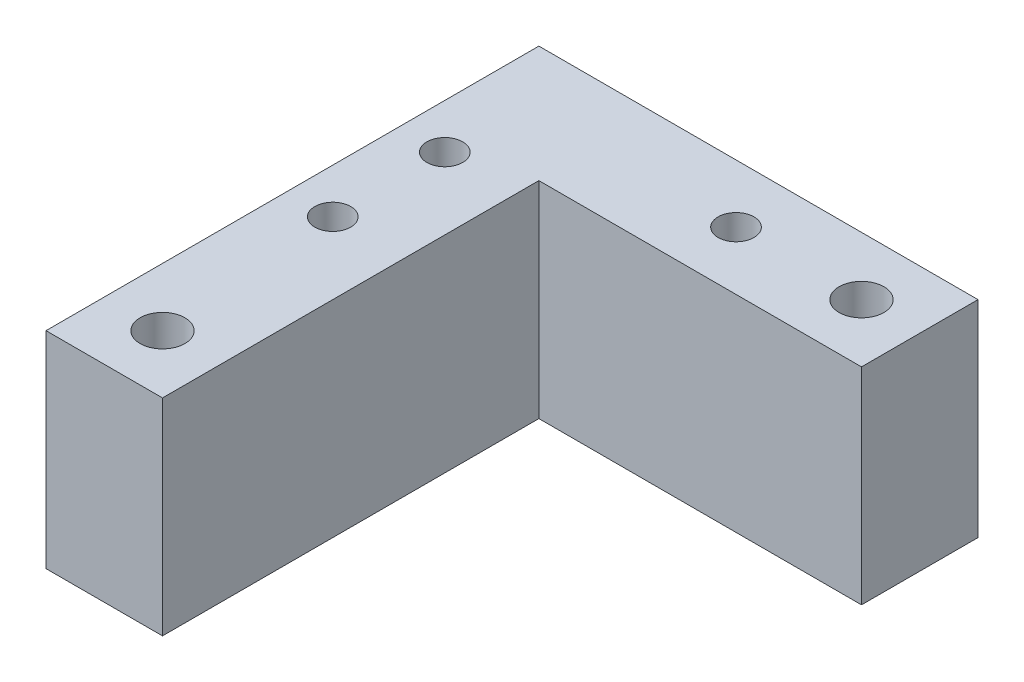
ISO-10303-21;
HEADER;
FILE_DESCRIPTION(('STEP AP214'),'2;1');
FILE_NAME('part.step','',(''),(''),'','','');
FILE_SCHEMA(('AUTOMOTIVE_DESIGN { 1 0 10303 214 1 1 1 1 }'));
ENDSEC;
DATA;
#1=APPLICATION_CONTEXT('core data for automotive mechanical design processes');
#2=APPLICATION_PROTOCOL_DEFINITION('international standard','automotive_design',2000,#1);
#3=PRODUCT_CONTEXT('',#1,'mechanical');
#4=PRODUCT('Part','Part','',(#3));
#5=PRODUCT_RELATED_PRODUCT_CATEGORY('part','',(#4));
#6=PRODUCT_DEFINITION_FORMATION('','',#4);
#7=PRODUCT_DEFINITION_CONTEXT('part definition',#1,'design');
#8=PRODUCT_DEFINITION('design','',#6,#7);
#9=PRODUCT_DEFINITION_SHAPE('','',#8);
#10=(LENGTH_UNIT() NAMED_UNIT(*) SI_UNIT(.MILLI.,.METRE.));
#11=(NAMED_UNIT(*) PLANE_ANGLE_UNIT() SI_UNIT($,.RADIAN.));
#12=(NAMED_UNIT(*) SI_UNIT($,.STERADIAN.) SOLID_ANGLE_UNIT());
#13=UNCERTAINTY_MEASURE_WITH_UNIT(LENGTH_MEASURE(1.E-05),#10,'distance_accuracy_value','');
#14=(GEOMETRIC_REPRESENTATION_CONTEXT(3) GLOBAL_UNCERTAINTY_ASSIGNED_CONTEXT((#13)) GLOBAL_UNIT_ASSIGNED_CONTEXT((#10,
#11,#12)) REPRESENTATION_CONTEXT('',''));
#15=CARTESIAN_POINT('',(0.,0.,0.));
#16=DIRECTION('',(0.,0.,1.));
#17=DIRECTION('',(1.,0.,0.));
#18=AXIS2_PLACEMENT_3D('',#15,#16,#17);
#19=CARTESIAN_POINT('',(-18.6079295154185,23.,-6.45154185022027));
#20=DIRECTION('',(0.,-1.,0.));
#21=DIRECTION('',(0.,0.,-1.));
#22=AXIS2_PLACEMENT_3D('',#19,#20,#21);
#23=CYLINDRICAL_SURFACE('',#22,2.);
#24=CARTESIAN_POINT('',(-18.6079295154185,23.,-6.45154185022027));
#25=DIRECTION('',(0.,1.,0.));
#26=DIRECTION('',(0.,0.,1.));
#27=AXIS2_PLACEMENT_3D('',#24,#25,#26);
#28=CIRCLE('',#27,2.);
#29=CARTESIAN_POINT('',(-18.6079295154185,23.,-4.45154185022027));
#30=VERTEX_POINT('',#29);
#31=EDGE_CURVE('E116',#30,#30,#28,.T.);
#32=ORIENTED_EDGE('',*,*,#31,.T.);
#33=EDGE_LOOP('',(#32));
#34=FACE_BOUND('',#33,.T.);
#35=CARTESIAN_POINT('',(-18.6079295154185,4.4,-6.45154185022027));
#36=DIRECTION('',(0.,-1.,0.));
#37=DIRECTION('',(0.,0.,-1.));
#38=AXIS2_PLACEMENT_3D('',#35,#36,#37);
#39=CIRCLE('',#38,2.);
#40=CARTESIAN_POINT('',(-18.6079295154185,4.4,-8.45154185022027));
#41=VERTEX_POINT('',#40);
#42=EDGE_CURVE('E37',#41,#41,#39,.T.);
#43=ORIENTED_EDGE('',*,*,#42,.T.);
#44=EDGE_LOOP('',(#43));
#45=FACE_BOUND('',#44,.T.);
#46=ADVANCED_FACE('F33',(#34,#45),#23,.F.);
#47=CARTESIAN_POINT('',(4.89207048458148,23.,-15.4515418502203));
#48=DIRECTION('',(0.,-1.,0.));
#49=DIRECTION('',(0.,0.,-1.));
#50=AXIS2_PLACEMENT_3D('',#47,#48,#49);
#51=CYLINDRICAL_SURFACE('',#50,2.);
#52=CARTESIAN_POINT('',(4.89207048458148,23.,-15.4515418502203));
#53=DIRECTION('',(0.,1.,0.));
#54=DIRECTION('',(0.,0.,1.));
#55=AXIS2_PLACEMENT_3D('',#52,#53,#54);
#56=CIRCLE('',#55,2.);
#57=CARTESIAN_POINT('',(4.89207048458148,23.,-13.4515418502203));
#58=VERTEX_POINT('',#57);
#59=EDGE_CURVE('E98',#58,#58,#56,.T.);
#60=ORIENTED_EDGE('',*,*,#59,.T.);
#61=EDGE_LOOP('',(#60));
#62=FACE_BOUND('',#61,.T.);
#63=CARTESIAN_POINT('',(4.89207048458148,4.4,-15.4515418502203));
#64=DIRECTION('',(0.,-1.,0.));
#65=DIRECTION('',(0.,0.,-1.));
#66=AXIS2_PLACEMENT_3D('',#63,#64,#65);
#67=CIRCLE('',#66,2.);
#68=CARTESIAN_POINT('',(4.89207048458148,4.4,-17.4515418502203));
#69=VERTEX_POINT('',#68);
#70=EDGE_CURVE('E138',#69,#69,#67,.T.);
#71=ORIENTED_EDGE('',*,*,#70,.T.);
#72=EDGE_LOOP('',(#71));
#73=FACE_BOUND('',#72,.T.);
#74=ADVANCED_FACE('F207',(#62,#73),#51,.F.);
#75=CARTESIAN_POINT('',(-18.6079295154185,23.,6.04845814977973));
#76=DIRECTION('',(0.,-1.,0.));
#77=DIRECTION('',(0.,0.,-1.));
#78=AXIS2_PLACEMENT_3D('',#75,#76,#77);
#79=CYLINDRICAL_SURFACE('',#78,2.);
#80=CARTESIAN_POINT('',(-18.6079295154185,23.,6.04845814977973));
#81=DIRECTION('',(0.,1.,0.));
#82=DIRECTION('',(0.,0.,1.));
#83=AXIS2_PLACEMENT_3D('',#80,#81,#82);
#84=CIRCLE('',#83,2.);
#85=CARTESIAN_POINT('',(-18.6079295154185,23.,8.04845814977973));
#86=VERTEX_POINT('',#85);
#87=EDGE_CURVE('E119',#86,#86,#84,.T.);
#88=ORIENTED_EDGE('',*,*,#87,.T.);
#89=EDGE_LOOP('',(#88));
#90=FACE_BOUND('',#89,.T.);
#91=CARTESIAN_POINT('',(-18.6079295154185,4.4,6.04845814977973));
#92=DIRECTION('',(0.,-1.,0.));
#93=DIRECTION('',(0.,0.,-1.));
#94=AXIS2_PLACEMENT_3D('',#91,#92,#93);
#95=CIRCLE('',#94,2.);
#96=CARTESIAN_POINT('',(-18.6079295154185,4.4,4.04845814977973));
#97=VERTEX_POINT('',#96);
#98=EDGE_CURVE('E134',#97,#97,#95,.T.);
#99=ORIENTED_EDGE('',*,*,#98,.T.);
#100=EDGE_LOOP('',(#99));
#101=FACE_BOUND('',#100,.T.);
#102=ADVANCED_FACE('F214',(#90,#101),#79,.F.);
#103=CARTESIAN_POINT('',(0.,23.,0.));
#104=DIRECTION('',(0.,-1.,0.));
#105=DIRECTION('',(0.,0.,-1.));
#106=AXIS2_PLACEMENT_3D('',#103,#104,#105);
#107=PLANE('',#106);
#108=CARTESIAN_POINT('',(-17.1079295154185,23.,26.5484581497797));
#109=DIRECTION('',(0.,1.,0.));
#110=DIRECTION('',(0.,0.,1.));
#111=AXIS2_PLACEMENT_3D('',#108,#109,#110);
#112=CIRCLE('',#111,2.5);
#113=CARTESIAN_POINT('',(-17.1079295154185,23.,29.0484581497797));
#114=VERTEX_POINT('',#113);
#115=EDGE_CURVE('E136',#114,#114,#112,.T.);
#116=ORIENTED_EDGE('',*,*,#115,.F.);
#117=EDGE_LOOP('',(#116));
#118=FACE_BOUND('',#117,.T.);
#119=CARTESIAN_POINT('',(18.8920704845815,23.,-15.4515418502203));
#120=DIRECTION('',(0.,1.,0.));
#121=DIRECTION('',(0.,0.,1.));
#122=AXIS2_PLACEMENT_3D('',#119,#120,#121);
#123=CIRCLE('',#122,2.5);
#124=CARTESIAN_POINT('',(18.8920704845815,23.,-12.9515418502203));
#125=VERTEX_POINT('',#124);
#126=EDGE_CURVE('E166',#125,#125,#123,.T.);
#127=ORIENTED_EDGE('',*,*,#126,.F.);
#128=EDGE_LOOP('',(#127));
#129=FACE_BOUND('',#128,.T.);
#130=DIRECTION('',(0.,0.,1.));
#131=VECTOR('',#130,1.);
#132=CARTESIAN_POINT('',(-23.6079295154185,23.,18.0484581497797));
#133=LINE('',#132,#131);
#134=CARTESIAN_POINT('',(-23.6079295154185,23.,-21.9515418502203));
#135=VERTEX_POINT('',#134);
#136=CARTESIAN_POINT('',(-23.6079295154185,23.,33.0484581497797));
#137=VERTEX_POINT('',#136);
#138=EDGE_CURVE('E89',#135,#137,#133,.T.);
#139=ORIENTED_EDGE('',*,*,#138,.T.);
#140=DIRECTION('',(1.,0.,0.));
#141=VECTOR('',#140,1.);
#142=CARTESIAN_POINT('',(-23.6079295154185,23.,33.0484581497797));
#143=LINE('',#142,#141);
#144=CARTESIAN_POINT('',(-10.6079295154185,23.,33.0484581497797));
#145=VERTEX_POINT('',#144);
#146=EDGE_CURVE('E172',#137,#145,#143,.T.);
#147=ORIENTED_EDGE('',*,*,#146,.T.);
#148=DIRECTION('',(0.,0.,-1.));
#149=VECTOR('',#148,1.);
#150=CARTESIAN_POINT('',(-10.6079295154185,23.,-8.95154185022026));
#151=LINE('',#150,#149);
#152=CARTESIAN_POINT('',(-10.6079295154185,23.,-8.95154185022026));
#153=VERTEX_POINT('',#152);
#154=EDGE_CURVE('E122',#145,#153,#151,.T.);
#155=ORIENTED_EDGE('',*,*,#154,.T.);
#156=DIRECTION('',(1.,0.,0.));
#157=VECTOR('',#156,1.);
#158=CARTESIAN_POINT('',(10.3920704845815,23.,-8.95154185022026));
#159=LINE('',#158,#157);
#160=CARTESIAN_POINT('',(25.3920704845815,23.,-8.95154185022027));
#161=VERTEX_POINT('',#160);
#162=EDGE_CURVE('E90',#153,#161,#159,.T.);
#163=ORIENTED_EDGE('',*,*,#162,.T.);
#164=DIRECTION('',(0.,0.,-1.));
#165=VECTOR('',#164,1.);
#166=CARTESIAN_POINT('',(25.3920704845815,23.,-21.9515418502203));
#167=LINE('',#166,#165);
#168=CARTESIAN_POINT('',(25.3920704845815,23.,-21.9515418502203));
#169=VERTEX_POINT('',#168);
#170=EDGE_CURVE('E96',#161,#169,#167,.T.);
#171=ORIENTED_EDGE('',*,*,#170,.T.);
#172=DIRECTION('',(-1.,0.,0.));
#173=VECTOR('',#172,1.);
#174=CARTESIAN_POINT('',(-23.6079295154185,23.,-21.9515418502203));
#175=LINE('',#174,#173);
#176=EDGE_CURVE('E52',#169,#135,#175,.T.);
#177=ORIENTED_EDGE('',*,*,#176,.T.);
#178=EDGE_LOOP('',(#139,#147,#155,#163,#171,#177));
#179=FACE_BOUND('',#178,.T.);
#180=ORIENTED_EDGE('',*,*,#87,.F.);
#181=EDGE_LOOP('',(#180));
#182=FACE_BOUND('',#181,.T.);
#183=ORIENTED_EDGE('',*,*,#31,.F.);
#184=EDGE_LOOP('',(#183));
#185=FACE_BOUND('',#184,.T.);
#186=ORIENTED_EDGE('',*,*,#59,.F.);
#187=EDGE_LOOP('',(#186));
#188=FACE_BOUND('',#187,.T.);
#189=ADVANCED_FACE('F101',(#118,#129,#179,#182,#185,#188),#107,.F.);
#190=CARTESIAN_POINT('',(0.,0.,0.));
#191=DIRECTION('',(0.,-1.,0.));
#192=DIRECTION('',(0.,0.,-1.));
#193=AXIS2_PLACEMENT_3D('',#190,#191,#192);
#194=PLANE('',#193);
#195=CARTESIAN_POINT('',(-18.6079295154185,0.,-6.45154185022027));
#196=DIRECTION('',(0.,-1.,0.));
#197=DIRECTION('',(0.,0.,-1.));
#198=AXIS2_PLACEMENT_3D('',#195,#196,#197);
#199=CIRCLE('',#198,4.);
#200=CARTESIAN_POINT('',(-18.6079295154185,0.,-10.4515418502203));
#201=VERTEX_POINT('',#200);
#202=EDGE_CURVE('E146',#201,#201,#199,.T.);
#203=ORIENTED_EDGE('',*,*,#202,.F.);
#204=EDGE_LOOP('',(#203));
#205=FACE_BOUND('',#204,.T.);
#206=CARTESIAN_POINT('',(4.89207048458148,0.,-15.4515418502203));
#207=DIRECTION('',(0.,-1.,0.));
#208=DIRECTION('',(0.,0.,-1.));
#209=AXIS2_PLACEMENT_3D('',#206,#207,#208);
#210=CIRCLE('',#209,4.);
#211=CARTESIAN_POINT('',(4.89207048458148,0.,-19.4515418502203));
#212=VERTEX_POINT('',#211);
#213=EDGE_CURVE('E156',#212,#212,#210,.T.);
#214=ORIENTED_EDGE('',*,*,#213,.F.);
#215=EDGE_LOOP('',(#214));
#216=FACE_BOUND('',#215,.T.);
#217=CARTESIAN_POINT('',(-18.6079295154185,0.,6.04845814977973));
#218=DIRECTION('',(0.,-1.,0.));
#219=DIRECTION('',(0.,0.,-1.));
#220=AXIS2_PLACEMENT_3D('',#217,#218,#219);
#221=CIRCLE('',#220,4.);
#222=CARTESIAN_POINT('',(-18.6079295154185,0.,2.04845814977973));
#223=VERTEX_POINT('',#222);
#224=EDGE_CURVE('E144',#223,#223,#221,.T.);
#225=ORIENTED_EDGE('',*,*,#224,.F.);
#226=EDGE_LOOP('',(#225));
#227=FACE_BOUND('',#226,.T.);
#228=CARTESIAN_POINT('',(-17.1079295154185,0.,26.5484581497797));
#229=DIRECTION('',(0.,1.,0.));
#230=DIRECTION('',(0.,0.,1.));
#231=AXIS2_PLACEMENT_3D('',#228,#229,#230);
#232=CIRCLE('',#231,2.5);
#233=CARTESIAN_POINT('',(-17.1079295154185,0.,29.0484581497797));
#234=VERTEX_POINT('',#233);
#235=EDGE_CURVE('E163',#234,#234,#232,.T.);
#236=ORIENTED_EDGE('',*,*,#235,.T.);
#237=EDGE_LOOP('',(#236));
#238=FACE_BOUND('',#237,.T.);
#239=CARTESIAN_POINT('',(18.8920704845815,0.,-15.4515418502203));
#240=DIRECTION('',(0.,1.,0.));
#241=DIRECTION('',(0.,0.,1.));
#242=AXIS2_PLACEMENT_3D('',#239,#240,#241);
#243=CIRCLE('',#242,2.5);
#244=CARTESIAN_POINT('',(18.8920704845815,0.,-12.9515418502203));
#245=VERTEX_POINT('',#244);
#246=EDGE_CURVE('E169',#245,#245,#243,.T.);
#247=ORIENTED_EDGE('',*,*,#246,.T.);
#248=EDGE_LOOP('',(#247));
#249=FACE_BOUND('',#248,.T.);
#250=DIRECTION('',(0.,0.,-1.));
#251=VECTOR('',#250,1.);
#252=CARTESIAN_POINT('',(-10.6079295154185,0.,-8.95154185022026));
#253=LINE('',#252,#251);
#254=CARTESIAN_POINT('',(-10.6079295154185,0.,33.0484581497797));
#255=VERTEX_POINT('',#254);
#256=CARTESIAN_POINT('',(-10.6079295154185,0.,-8.95154185022026));
#257=VERTEX_POINT('',#256);
#258=EDGE_CURVE('E64',#255,#257,#253,.T.);
#259=ORIENTED_EDGE('',*,*,#258,.F.);
#260=DIRECTION('',(1.,0.,0.));
#261=VECTOR('',#260,1.);
#262=CARTESIAN_POINT('',(-23.6079295154185,0.,33.0484581497797));
#263=LINE('',#262,#261);
#264=CARTESIAN_POINT('',(-23.6079295154185,0.,33.0484581497797));
#265=VERTEX_POINT('',#264);
#266=EDGE_CURVE('E175',#265,#255,#263,.T.);
#267=ORIENTED_EDGE('',*,*,#266,.F.);
#268=DIRECTION('',(0.,0.,1.));
#269=VECTOR('',#268,1.);
#270=CARTESIAN_POINT('',(-23.6079295154185,0.,18.0484581497797));
#271=LINE('',#270,#269);
#272=CARTESIAN_POINT('',(-23.6079295154185,0.,-21.9515418502203));
#273=VERTEX_POINT('',#272);
#274=EDGE_CURVE('E124',#273,#265,#271,.T.);
#275=ORIENTED_EDGE('',*,*,#274,.F.);
#276=DIRECTION('',(-1.,0.,0.));
#277=VECTOR('',#276,1.);
#278=CARTESIAN_POINT('',(-23.6079295154185,0.,-21.9515418502203));
#279=LINE('',#278,#277);
#280=CARTESIAN_POINT('',(25.3920704845815,0.,-21.9515418502203));
#281=VERTEX_POINT('',#280);
#282=EDGE_CURVE('E72',#281,#273,#279,.T.);
#283=ORIENTED_EDGE('',*,*,#282,.F.);
#284=DIRECTION('',(0.,0.,-1.));
#285=VECTOR('',#284,1.);
#286=CARTESIAN_POINT('',(25.3920704845815,0.,-21.9515418502203));
#287=LINE('',#286,#285);
#288=CARTESIAN_POINT('',(25.3920704845815,0.,-8.95154185022027));
#289=VERTEX_POINT('',#288);
#290=EDGE_CURVE('E97',#289,#281,#287,.T.);
#291=ORIENTED_EDGE('',*,*,#290,.F.);
#292=DIRECTION('',(1.,0.,0.));
#293=VECTOR('',#292,1.);
#294=CARTESIAN_POINT('',(10.3920704845815,0.,-8.95154185022026));
#295=LINE('',#294,#293);
#296=EDGE_CURVE('E128',#257,#289,#295,.T.);
#297=ORIENTED_EDGE('',*,*,#296,.F.);
#298=EDGE_LOOP('',(#259,#267,#275,#283,#291,#297));
#299=FACE_BOUND('',#298,.T.);
#300=ADVANCED_FACE('F195',(#205,#216,#227,#238,#249,#299),#194,.T.);
#301=CARTESIAN_POINT('',(-10.6079295154185,23.,-8.95154185022026));
#302=DIRECTION('',(-1.,0.,0.));
#303=DIRECTION('',(0.,0.,1.));
#304=AXIS2_PLACEMENT_3D('',#301,#302,#303);
#305=PLANE('',#304);
#306=ORIENTED_EDGE('',*,*,#258,.T.);
#307=DIRECTION('',(0.,-1.,0.));
#308=VECTOR('',#307,1.);
#309=CARTESIAN_POINT('',(-10.6079295154185,23.,-8.95154185022026));
#310=LINE('',#309,#308);
#311=EDGE_CURVE('E11',#153,#257,#310,.T.);
#312=ORIENTED_EDGE('',*,*,#311,.F.);
#313=ORIENTED_EDGE('',*,*,#154,.F.);
#314=DIRECTION('',(0.,1.,0.));
#315=VECTOR('',#314,1.);
#316=CARTESIAN_POINT('',(-10.6079295154185,0.,33.0484581497797));
#317=LINE('',#316,#315);
#318=EDGE_CURVE('E105',#255,#145,#317,.T.);
#319=ORIENTED_EDGE('',*,*,#318,.F.);
#320=EDGE_LOOP('',(#306,#312,#313,#319));
#321=FACE_BOUND('',#320,.T.);
#322=ADVANCED_FACE('F35',(#321),#305,.F.);
#323=CARTESIAN_POINT('',(10.3920704845815,23.,-8.95154185022026));
#324=DIRECTION('',(0.,0.,-1.));
#325=DIRECTION('',(-1.,0.,0.));
#326=AXIS2_PLACEMENT_3D('',#323,#324,#325);
#327=PLANE('',#326);
#328=ORIENTED_EDGE('',*,*,#296,.T.);
#329=DIRECTION('',(0.,1.,0.));
#330=VECTOR('',#329,1.);
#331=CARTESIAN_POINT('',(25.3920704845815,0.,-8.95154185022027));
#332=LINE('',#331,#330);
#333=EDGE_CURVE('E99',#289,#161,#332,.T.);
#334=ORIENTED_EDGE('',*,*,#333,.T.);
#335=ORIENTED_EDGE('',*,*,#162,.F.);
#336=ORIENTED_EDGE('',*,*,#311,.T.);
#337=EDGE_LOOP('',(#328,#334,#335,#336));
#338=FACE_BOUND('',#337,.T.);
#339=ADVANCED_FACE('F197',(#338),#327,.F.);
#340=CARTESIAN_POINT('',(-23.6079295154185,23.,-21.9515418502203));
#341=DIRECTION('',(0.,0.,1.));
#342=DIRECTION('',(1.,0.,0.));
#343=AXIS2_PLACEMENT_3D('',#340,#341,#342);
#344=PLANE('',#343);
#345=ORIENTED_EDGE('',*,*,#282,.T.);
#346=DIRECTION('',(0.,-1.,0.));
#347=VECTOR('',#346,1.);
#348=CARTESIAN_POINT('',(-23.6079295154185,23.,-21.9515418502203));
#349=LINE('',#348,#347);
#350=EDGE_CURVE('E43',#135,#273,#349,.T.);
#351=ORIENTED_EDGE('',*,*,#350,.F.);
#352=ORIENTED_EDGE('',*,*,#176,.F.);
#353=DIRECTION('',(0.,1.,0.));
#354=VECTOR('',#353,1.);
#355=CARTESIAN_POINT('',(25.3920704845815,0.,-21.9515418502203));
#356=LINE('',#355,#354);
#357=EDGE_CURVE('E85',#281,#169,#356,.T.);
#358=ORIENTED_EDGE('',*,*,#357,.F.);
#359=EDGE_LOOP('',(#345,#351,#352,#358));
#360=FACE_BOUND('',#359,.T.);
#361=ADVANCED_FACE('F84',(#360),#344,.F.);
#362=CARTESIAN_POINT('',(-23.6079295154185,23.,18.0484581497797));
#363=DIRECTION('',(1.,0.,0.));
#364=DIRECTION('',(0.,0.,-1.));
#365=AXIS2_PLACEMENT_3D('',#362,#363,#364);
#366=PLANE('',#365);
#367=ORIENTED_EDGE('',*,*,#274,.T.);
#368=DIRECTION('',(0.,1.,0.));
#369=VECTOR('',#368,1.);
#370=CARTESIAN_POINT('',(-23.6079295154185,0.,33.0484581497797));
#371=LINE('',#370,#369);
#372=EDGE_CURVE('E109',#265,#137,#371,.T.);
#373=ORIENTED_EDGE('',*,*,#372,.T.);
#374=ORIENTED_EDGE('',*,*,#138,.F.);
#375=ORIENTED_EDGE('',*,*,#350,.T.);
#376=EDGE_LOOP('',(#367,#373,#374,#375));
#377=FACE_BOUND('',#376,.T.);
#378=ADVANCED_FACE('F184',(#377),#366,.F.);
#379=CARTESIAN_POINT('',(25.3920704845815,0.,-21.9515418502203));
#380=DIRECTION('',(1.,0.,0.));
#381=DIRECTION('',(0.,0.,-1.));
#382=AXIS2_PLACEMENT_3D('',#379,#380,#381);
#383=PLANE('',#382);
#384=ORIENTED_EDGE('',*,*,#170,.F.);
#385=ORIENTED_EDGE('',*,*,#333,.F.);
#386=ORIENTED_EDGE('',*,*,#290,.T.);
#387=ORIENTED_EDGE('',*,*,#357,.T.);
#388=EDGE_LOOP('',(#384,#385,#386,#387));
#389=FACE_BOUND('',#388,.T.);
#390=ADVANCED_FACE('F94',(#389),#383,.T.);
#391=CARTESIAN_POINT('',(-23.6079295154185,0.,33.0484581497797));
#392=DIRECTION('',(0.,0.,1.));
#393=DIRECTION('',(1.,0.,0.));
#394=AXIS2_PLACEMENT_3D('',#391,#392,#393);
#395=PLANE('',#394);
#396=ORIENTED_EDGE('',*,*,#146,.F.);
#397=ORIENTED_EDGE('',*,*,#372,.F.);
#398=ORIENTED_EDGE('',*,*,#266,.T.);
#399=ORIENTED_EDGE('',*,*,#318,.T.);
#400=EDGE_LOOP('',(#396,#397,#398,#399));
#401=FACE_BOUND('',#400,.T.);
#402=ADVANCED_FACE('F190',(#401),#395,.T.);
#403=CARTESIAN_POINT('',(18.8920704845815,0.,-15.4515418502203));
#404=DIRECTION('',(0.,1.,0.));
#405=DIRECTION('',(0.,0.,1.));
#406=AXIS2_PLACEMENT_3D('',#403,#404,#405);
#407=CYLINDRICAL_SURFACE('',#406,2.5);
#408=ORIENTED_EDGE('',*,*,#246,.F.);
#409=EDGE_LOOP('',(#408));
#410=FACE_BOUND('',#409,.T.);
#411=ORIENTED_EDGE('',*,*,#126,.T.);
#412=EDGE_LOOP('',(#411));
#413=FACE_BOUND('',#412,.T.);
#414=ADVANCED_FACE('F248',(#410,#413),#407,.F.);
#415=CARTESIAN_POINT('',(-17.1079295154185,0.,26.5484581497797));
#416=DIRECTION('',(0.,1.,0.));
#417=DIRECTION('',(0.,0.,1.));
#418=AXIS2_PLACEMENT_3D('',#415,#416,#417);
#419=CYLINDRICAL_SURFACE('',#418,2.5);
#420=ORIENTED_EDGE('',*,*,#235,.F.);
#421=EDGE_LOOP('',(#420));
#422=FACE_BOUND('',#421,.T.);
#423=ORIENTED_EDGE('',*,*,#115,.T.);
#424=EDGE_LOOP('',(#423));
#425=FACE_BOUND('',#424,.T.);
#426=ADVANCED_FACE('F256',(#422,#425),#419,.F.);
#427=CARTESIAN_POINT('',(-18.6079295154185,4.4,6.04845814977973));
#428=DIRECTION('',(0.,-1.,0.));
#429=DIRECTION('',(0.,0.,-1.));
#430=AXIS2_PLACEMENT_3D('',#427,#428,#429);
#431=CYLINDRICAL_SURFACE('',#430,4.);
#432=CARTESIAN_POINT('',(-18.6079295154185,4.4,6.04845814977973));
#433=DIRECTION('',(0.,-1.,0.));
#434=DIRECTION('',(0.,0.,-1.));
#435=AXIS2_PLACEMENT_3D('',#432,#433,#434);
#436=CIRCLE('',#435,4.);
#437=CARTESIAN_POINT('',(-18.6079295154185,4.4,2.04845814977973));
#438=VERTEX_POINT('',#437);
#439=EDGE_CURVE('E137',#438,#438,#436,.T.);
#440=ORIENTED_EDGE('',*,*,#439,.F.);
#441=EDGE_LOOP('',(#440));
#442=FACE_BOUND('',#441,.T.);
#443=ORIENTED_EDGE('',*,*,#224,.T.);
#444=EDGE_LOOP('',(#443));
#445=FACE_BOUND('',#444,.T.);
#446=ADVANCED_FACE('F263',(#442,#445),#431,.F.);
#447=CARTESIAN_POINT('',(-18.6079295154185,4.4,6.04845814977973));
#448=DIRECTION('',(0.,-1.,0.));
#449=DIRECTION('',(0.,0.,-1.));
#450=AXIS2_PLACEMENT_3D('',#447,#448,#449);
#451=PLANE('',#450);
#452=ORIENTED_EDGE('',*,*,#98,.F.);
#453=EDGE_LOOP('',(#452));
#454=FACE_BOUND('',#453,.T.);
#455=ORIENTED_EDGE('',*,*,#439,.T.);
#456=EDGE_LOOP('',(#455));
#457=FACE_BOUND('',#456,.T.);
#458=ADVANCED_FACE('F286',(#454,#457),#451,.T.);
#459=CARTESIAN_POINT('',(4.89207048458148,4.4,-15.4515418502203));
#460=DIRECTION('',(0.,-1.,0.));
#461=DIRECTION('',(0.,0.,-1.));
#462=AXIS2_PLACEMENT_3D('',#459,#460,#461);
#463=CYLINDRICAL_SURFACE('',#462,4.);
#464=CARTESIAN_POINT('',(4.89207048458148,4.4,-15.4515418502203));
#465=DIRECTION('',(0.,-1.,0.));
#466=DIRECTION('',(0.,0.,-1.));
#467=AXIS2_PLACEMENT_3D('',#464,#465,#466);
#468=CIRCLE('',#467,4.);
#469=CARTESIAN_POINT('',(4.89207048458148,4.4,-19.4515418502203));
#470=VERTEX_POINT('',#469);
#471=EDGE_CURVE('E151',#470,#470,#468,.T.);
#472=ORIENTED_EDGE('',*,*,#471,.F.);
#473=EDGE_LOOP('',(#472));
#474=FACE_BOUND('',#473,.T.);
#475=ORIENTED_EDGE('',*,*,#213,.T.);
#476=EDGE_LOOP('',(#475));
#477=FACE_BOUND('',#476,.T.);
#478=ADVANCED_FACE('F293',(#474,#477),#463,.F.);
#479=CARTESIAN_POINT('',(4.89207048458148,4.4,-15.4515418502203));
#480=DIRECTION('',(0.,-1.,0.));
#481=DIRECTION('',(0.,0.,-1.));
#482=AXIS2_PLACEMENT_3D('',#479,#480,#481);
#483=PLANE('',#482);
#484=ORIENTED_EDGE('',*,*,#70,.F.);
#485=EDGE_LOOP('',(#484));
#486=FACE_BOUND('',#485,.T.);
#487=ORIENTED_EDGE('',*,*,#471,.T.);
#488=EDGE_LOOP('',(#487));
#489=FACE_BOUND('',#488,.T.);
#490=ADVANCED_FACE('F301',(#486,#489),#483,.T.);
#491=CARTESIAN_POINT('',(-18.6079295154185,4.4,-6.45154185022027));
#492=DIRECTION('',(0.,-1.,0.));
#493=DIRECTION('',(0.,0.,-1.));
#494=AXIS2_PLACEMENT_3D('',#491,#492,#493);
#495=CYLINDRICAL_SURFACE('',#494,4.);
#496=CARTESIAN_POINT('',(-18.6079295154185,4.4,-6.45154185022027));
#497=DIRECTION('',(0.,-1.,0.));
#498=DIRECTION('',(0.,0.,-1.));
#499=AXIS2_PLACEMENT_3D('',#496,#497,#498);
#500=CIRCLE('',#499,4.);
#501=CARTESIAN_POINT('',(-18.6079295154185,4.4,-10.4515418502203));
#502=VERTEX_POINT('',#501);
#503=EDGE_CURVE('E140',#502,#502,#500,.T.);
#504=ORIENTED_EDGE('',*,*,#503,.F.);
#505=EDGE_LOOP('',(#504));
#506=FACE_BOUND('',#505,.T.);
#507=ORIENTED_EDGE('',*,*,#202,.T.);
#508=EDGE_LOOP('',(#507));
#509=FACE_BOUND('',#508,.T.);
#510=ADVANCED_FACE('F309',(#506,#509),#495,.F.);
#511=CARTESIAN_POINT('',(-18.6079295154185,4.4,-6.45154185022027));
#512=DIRECTION('',(0.,-1.,0.));
#513=DIRECTION('',(0.,0.,-1.));
#514=AXIS2_PLACEMENT_3D('',#511,#512,#513);
#515=PLANE('',#514);
#516=ORIENTED_EDGE('',*,*,#42,.F.);
#517=EDGE_LOOP('',(#516));
#518=FACE_BOUND('',#517,.T.);
#519=ORIENTED_EDGE('',*,*,#503,.T.);
#520=EDGE_LOOP('',(#519));
#521=FACE_BOUND('',#520,.T.);
#522=ADVANCED_FACE('F317',(#518,#521),#515,.T.);
#523=CLOSED_SHELL('',(#46,#74,#102,#189,#300,#322,#339,#361,#378,#390,#402,#414,#426,#446,#458,
#478,#490,#510,#522));
#524=MANIFOLD_SOLID_BREP('B2',#523);
#525=ADVANCED_BREP_SHAPE_REPRESENTATION('',(#18,#524),#14);
#526=SHAPE_DEFINITION_REPRESENTATION(#9,#525);
ENDSEC;
END-ISO-10303-21;
